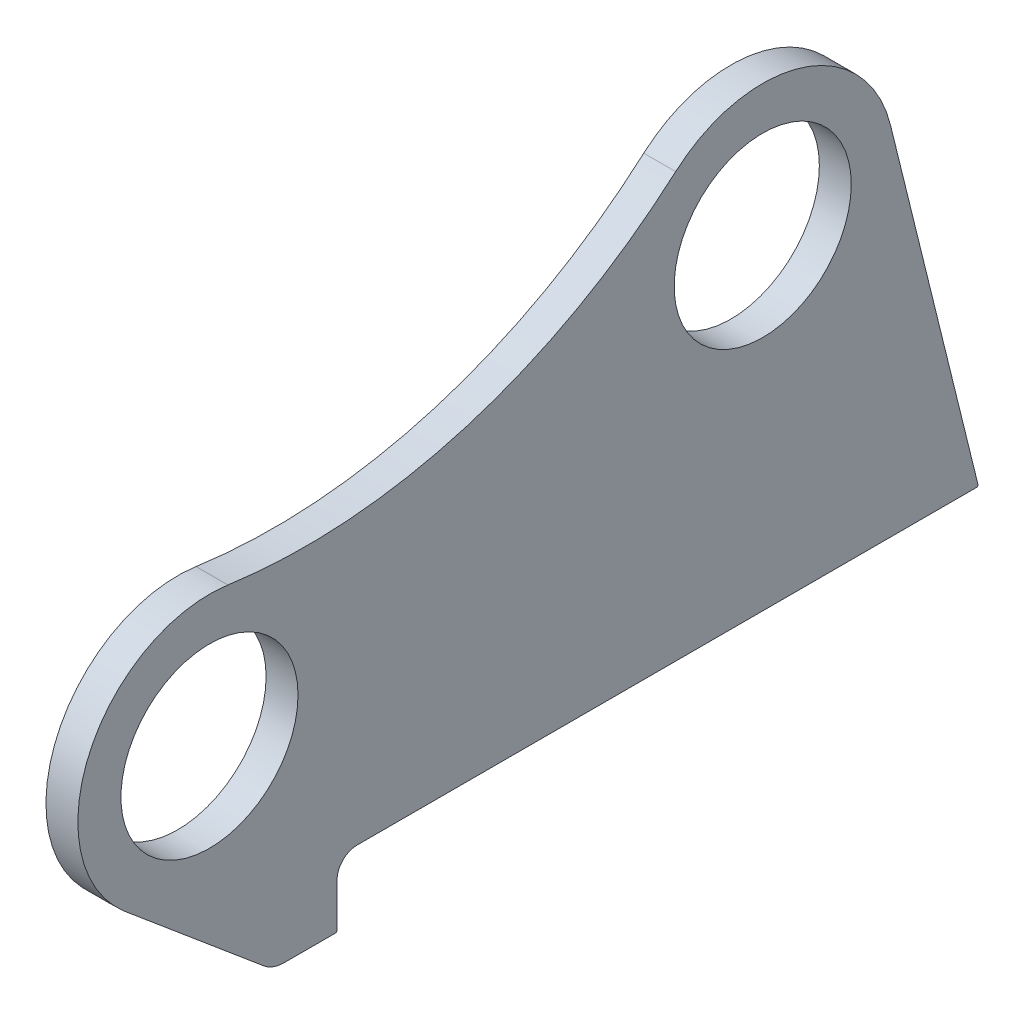
ISO-10303-21;
HEADER;
FILE_DESCRIPTION(('STEP AP214'),'2;1');
FILE_NAME('part.step','',(''),(''),'','','');
FILE_SCHEMA(('AUTOMOTIVE_DESIGN { 1 0 10303 214 1 1 1 1 }'));
ENDSEC;
DATA;
#1=APPLICATION_CONTEXT('core data for automotive mechanical design processes');
#2=APPLICATION_PROTOCOL_DEFINITION('international standard','automotive_design',2000,#1);
#3=PRODUCT_CONTEXT('',#1,'mechanical');
#4=PRODUCT('Part','Part','',(#3));
#5=PRODUCT_RELATED_PRODUCT_CATEGORY('part','',(#4));
#6=PRODUCT_DEFINITION_FORMATION('','',#4);
#7=PRODUCT_DEFINITION_CONTEXT('part definition',#1,'design');
#8=PRODUCT_DEFINITION('design','',#6,#7);
#9=PRODUCT_DEFINITION_SHAPE('','',#8);
#10=(LENGTH_UNIT() NAMED_UNIT(*) SI_UNIT(.MILLI.,.METRE.));
#11=(NAMED_UNIT(*) PLANE_ANGLE_UNIT() SI_UNIT($,.RADIAN.));
#12=(NAMED_UNIT(*) SI_UNIT($,.STERADIAN.) SOLID_ANGLE_UNIT());
#13=UNCERTAINTY_MEASURE_WITH_UNIT(LENGTH_MEASURE(1.E-05),#10,'distance_accuracy_value','');
#14=(GEOMETRIC_REPRESENTATION_CONTEXT(3) GLOBAL_UNCERTAINTY_ASSIGNED_CONTEXT((#13)) GLOBAL_UNIT_ASSIGNED_CONTEXT((#10,
#11,#12)) REPRESENTATION_CONTEXT('',''));
#15=CARTESIAN_POINT('',(0.,0.,0.));
#16=DIRECTION('',(0.,0.,1.));
#17=DIRECTION('',(1.,0.,0.));
#18=AXIS2_PLACEMENT_3D('',#15,#16,#17);
#19=CARTESIAN_POINT('',(-20.,528.222617801825,19.3234839253683));
#20=DIRECTION('',(1.,0.,0.));
#21=DIRECTION('',(0.,0.,-1.));
#22=AXIS2_PLACEMENT_3D('',#19,#20,#21);
#23=CYLINDRICAL_SURFACE('',#22,350.);
#24=CARTESIAN_POINT('',(0.,528.222617801825,19.3234839253683));
#25=DIRECTION('',(-1.,0.,0.));
#26=DIRECTION('',(0.,0.,-1.));
#27=AXIS2_PLACEMENT_3D('',#24,#25,#26);
#28=CIRCLE('',#27,350.);
#29=CARTESIAN_POINT('',(0.,265.74316224697,-212.203048920495));
#30=VERTEX_POINT('',#29);
#31=CARTESIAN_POINT('',(0.,181.684083164513,68.4258668759373));
#32=VERTEX_POINT('',#31);
#33=EDGE_CURVE('E179',#30,#32,#28,.T.);
#34=ORIENTED_EDGE('',*,*,#33,.F.);
#35=DIRECTION('',(1.,0.,0.));
#36=VECTOR('',#35,1.);
#37=CARTESIAN_POINT('',(-20.,265.74316224697,-212.203048920495));
#38=LINE('',#37,#36);
#39=CARTESIAN_POINT('',(-20.,265.74316224697,-212.203048920495));
#40=VERTEX_POINT('',#39);
#41=EDGE_CURVE('E152',#40,#30,#38,.T.);
#42=ORIENTED_EDGE('',*,*,#41,.F.);
#43=CARTESIAN_POINT('',(-20.,528.222617801825,19.3234839253683));
#44=DIRECTION('',(-1.,0.,0.));
#45=DIRECTION('',(0.,0.,-1.));
#46=AXIS2_PLACEMENT_3D('',#43,#44,#45);
#47=CIRCLE('',#46,350.);
#48=CARTESIAN_POINT('',(-20.,181.684083164513,68.4258668759373));
#49=VERTEX_POINT('',#48);
#50=EDGE_CURVE('E146',#40,#49,#47,.T.);
#51=ORIENTED_EDGE('',*,*,#50,.T.);
#52=DIRECTION('',(1.,0.,0.));
#53=VECTOR('',#52,1.);
#54=CARTESIAN_POINT('',(-20.,181.684083164513,68.4258668759373));
#55=LINE('',#54,#53);
#56=EDGE_CURVE('E128',#49,#32,#55,.T.);
#57=ORIENTED_EDGE('',*,*,#56,.T.);
#58=EDGE_LOOP('',(#34,#42,#51,#57));
#59=FACE_BOUND('',#58,.T.);
#60=ADVANCED_FACE('F39',(#59),#23,.F.);
#61=CARTESIAN_POINT('',(-20.,203.873004866183,-266.777160234163));
#62=DIRECTION('',(1.,0.,0.));
#63=DIRECTION('',(0.,0.,-1.));
#64=AXIS2_PLACEMENT_3D('',#61,#62,#63);
#65=CYLINDRICAL_SURFACE('',#64,82.5);
#66=CARTESIAN_POINT('',(0.,203.873004866183,-266.777160234163));
#67=DIRECTION('',(1.,0.,0.));
#68=DIRECTION('',(0.,0.,-1.));
#69=AXIS2_PLACEMENT_3D('',#66,#67,#68);
#70=CIRCLE('',#69,82.5);
#71=CARTESIAN_POINT('',(0.,223.617766638744,-346.879559589893));
#72=VERTEX_POINT('',#71);
#73=EDGE_CURVE('E153',#72,#30,#70,.T.);
#74=ORIENTED_EDGE('',*,*,#73,.F.);
#75=DIRECTION('',(1.,0.,0.));
#76=VECTOR('',#75,1.);
#77=CARTESIAN_POINT('',(-20.,223.617766638744,-346.879559589893));
#78=LINE('',#77,#76);
#79=CARTESIAN_POINT('',(-20.,223.617766638744,-346.879559589893));
#80=VERTEX_POINT('',#79);
#81=EDGE_CURVE('E203',#80,#72,#78,.T.);
#82=ORIENTED_EDGE('',*,*,#81,.F.);
#83=CARTESIAN_POINT('',(-20.,203.873004866183,-266.777160234163));
#84=DIRECTION('',(1.,0.,0.));
#85=DIRECTION('',(0.,0.,-1.));
#86=AXIS2_PLACEMENT_3D('',#83,#84,#85);
#87=CIRCLE('',#86,82.5);
#88=EDGE_CURVE('E139',#80,#40,#87,.T.);
#89=ORIENTED_EDGE('',*,*,#88,.T.);
#90=ORIENTED_EDGE('',*,*,#41,.T.);
#91=EDGE_LOOP('',(#74,#82,#89,#90));
#92=FACE_BOUND('',#91,.T.);
#93=ADVANCED_FACE('F244',(#92),#65,.T.);
#94=CARTESIAN_POINT('',(-20.,0.,-402.));
#95=DIRECTION('',(0.,0.239330445728009,-0.970938174008846));
#96=DIRECTION('',(0.,0.970938174008846,0.239330445728009));
#97=AXIS2_PLACEMENT_3D('',#94,#95,#96);
#98=PLANE('',#97);
#99=DIRECTION('',(0.,0.970938174008846,0.239330445728009));
#100=VECTOR('',#99,1.);
#101=CARTESIAN_POINT('',(0.,0.,-402.));
#102=LINE('',#101,#100);
#103=CARTESIAN_POINT('',(0.,1.239330445728,-401.694512466478));
#104=VERTEX_POINT('',#103);
#105=EDGE_CURVE('E156',#104,#72,#102,.T.);
#106=ORIENTED_EDGE('',*,*,#105,.F.);
#107=DIRECTION('',(1.,0.,0.));
#108=VECTOR('',#107,1.);
#109=CARTESIAN_POINT('',(-20.,1.239330445728,-401.694512466478));
#110=LINE('',#109,#108);
#111=CARTESIAN_POINT('',(-20.,1.239330445728,-401.694512466478));
#112=VERTEX_POINT('',#111);
#113=EDGE_CURVE('E222',#104,#112,#110,.F.);
#114=ORIENTED_EDGE('',*,*,#113,.T.);
#115=DIRECTION('',(0.,0.970938174008846,0.239330445728009));
#116=VECTOR('',#115,1.);
#117=CARTESIAN_POINT('',(-20.,0.,-402.));
#118=LINE('',#117,#116);
#119=EDGE_CURVE('E176',#112,#80,#118,.T.);
#120=ORIENTED_EDGE('',*,*,#119,.T.);
#121=ORIENTED_EDGE('',*,*,#81,.T.);
#122=EDGE_LOOP('',(#106,#114,#120,#121));
#123=FACE_BOUND('',#122,.T.);
#124=ADVANCED_FACE('F270',(#123),#98,.T.);
#125=CARTESIAN_POINT('',(-20.,0.,-12.5));
#126=DIRECTION('',(0.,-1.,0.));
#127=DIRECTION('',(0.,0.,-1.));
#128=AXIS2_PLACEMENT_3D('',#125,#126,#127);
#129=PLANE('',#128);
#130=DIRECTION('',(0.,0.,-1.));
#131=VECTOR('',#130,1.);
#132=CARTESIAN_POINT('',(-20.,0.,-12.5));
#133=LINE('',#132,#131);
#134=CARTESIAN_POINT('',(-20.,0.,-12.5));
#135=VERTEX_POINT('',#134);
#136=CARTESIAN_POINT('',(-20.,0.,-400.723574292469));
#137=VERTEX_POINT('',#136);
#138=EDGE_CURVE('E173',#135,#137,#133,.T.);
#139=ORIENTED_EDGE('',*,*,#138,.T.);
#140=DIRECTION('',(1.,0.,0.));
#141=VECTOR('',#140,1.);
#142=CARTESIAN_POINT('',(-20.,0.,-400.723574292469));
#143=LINE('',#142,#141);
#144=CARTESIAN_POINT('',(0.,0.,-400.723574292469));
#145=VERTEX_POINT('',#144);
#146=EDGE_CURVE('E202',#137,#145,#143,.T.);
#147=ORIENTED_EDGE('',*,*,#146,.T.);
#148=DIRECTION('',(0.,0.,-1.));
#149=VECTOR('',#148,1.);
#150=CARTESIAN_POINT('',(0.,0.,-12.5));
#151=LINE('',#150,#149);
#152=CARTESIAN_POINT('',(0.,0.,-12.5));
#153=VERTEX_POINT('',#152);
#154=EDGE_CURVE('E197',#153,#145,#151,.T.);
#155=ORIENTED_EDGE('',*,*,#154,.F.);
#156=DIRECTION('',(1.,0.,0.));
#157=VECTOR('',#156,1.);
#158=CARTESIAN_POINT('',(-20.,0.,-12.5));
#159=LINE('',#158,#157);
#160=EDGE_CURVE('E206',#135,#153,#159,.T.);
#161=ORIENTED_EDGE('',*,*,#160,.F.);
#162=EDGE_LOOP('',(#139,#147,#155,#161));
#163=FACE_BOUND('',#162,.T.);
#164=ADVANCED_FACE('F254',(#163),#129,.T.);
#165=CARTESIAN_POINT('',(-20.,-12.5,-12.5));
#166=DIRECTION('',(1.,0.,0.));
#167=DIRECTION('',(0.,0.,-1.));
#168=AXIS2_PLACEMENT_3D('',#165,#166,#167);
#169=CYLINDRICAL_SURFACE('',#168,12.5);
#170=CARTESIAN_POINT('',(0.,-12.5,-12.5));
#171=DIRECTION('',(-1.,0.,0.));
#172=DIRECTION('',(0.,0.,1.));
#173=AXIS2_PLACEMENT_3D('',#170,#171,#172);
#174=CIRCLE('',#173,12.5);
#175=CARTESIAN_POINT('',(0.,-12.5,0.));
#176=VERTEX_POINT('',#175);
#177=EDGE_CURVE('E194',#176,#153,#174,.T.);
#178=ORIENTED_EDGE('',*,*,#177,.F.);
#179=DIRECTION('',(1.,0.,0.));
#180=VECTOR('',#179,1.);
#181=CARTESIAN_POINT('',(-20.,-12.5,0.));
#182=LINE('',#181,#180);
#183=CARTESIAN_POINT('',(-20.,-12.5,0.));
#184=VERTEX_POINT('',#183);
#185=EDGE_CURVE('E208',#184,#176,#182,.T.);
#186=ORIENTED_EDGE('',*,*,#185,.F.);
#187=CARTESIAN_POINT('',(-20.,-12.5,-12.5));
#188=DIRECTION('',(-1.,0.,0.));
#189=DIRECTION('',(0.,0.,1.));
#190=AXIS2_PLACEMENT_3D('',#187,#188,#189);
#191=CIRCLE('',#190,12.5);
#192=EDGE_CURVE('E170',#184,#135,#191,.T.);
#193=ORIENTED_EDGE('',*,*,#192,.T.);
#194=ORIENTED_EDGE('',*,*,#160,.T.);
#195=EDGE_LOOP('',(#178,#186,#193,#194));
#196=FACE_BOUND('',#195,.T.);
#197=ADVANCED_FACE('F258',(#196),#169,.F.);
#198=CARTESIAN_POINT('',(-20.,-41.,0.));
#199=DIRECTION('',(0.,0.,-1.));
#200=DIRECTION('',(-1.,0.,0.));
#201=AXIS2_PLACEMENT_3D('',#198,#199,#200);
#202=PLANE('',#201);
#203=DIRECTION('',(0.,1.,0.));
#204=VECTOR('',#203,1.);
#205=CARTESIAN_POINT('',(0.,-41.,0.));
#206=LINE('',#205,#204);
#207=CARTESIAN_POINT('',(0.,-40.,0.));
#208=VERTEX_POINT('',#207);
#209=EDGE_CURVE('E192',#208,#176,#206,.T.);
#210=ORIENTED_EDGE('',*,*,#209,.F.);
#211=DIRECTION('',(1.,0.,0.));
#212=VECTOR('',#211,1.);
#213=CARTESIAN_POINT('',(-20.,-40.,0.));
#214=LINE('',#213,#212);
#215=CARTESIAN_POINT('',(-20.,-40.,0.));
#216=VERTEX_POINT('',#215);
#217=EDGE_CURVE('E11',#208,#216,#214,.F.);
#218=ORIENTED_EDGE('',*,*,#217,.T.);
#219=DIRECTION('',(0.,1.,0.));
#220=VECTOR('',#219,1.);
#221=CARTESIAN_POINT('',(-20.,-41.,0.));
#222=LINE('',#221,#220);
#223=EDGE_CURVE('E168',#216,#184,#222,.T.);
#224=ORIENTED_EDGE('',*,*,#223,.T.);
#225=ORIENTED_EDGE('',*,*,#185,.T.);
#226=EDGE_LOOP('',(#210,#218,#224,#225));
#227=FACE_BOUND('',#226,.T.);
#228=ADVANCED_FACE('F281',(#227),#202,.T.);
#229=CARTESIAN_POINT('',(-20.,-41.,0.));
#230=DIRECTION('',(0.,-1.,0.));
#231=DIRECTION('',(0.,0.,-1.));
#232=AXIS2_PLACEMENT_3D('',#229,#230,#231);
#233=PLANE('',#232);
#234=DIRECTION('',(0.,0.,-1.));
#235=VECTOR('',#234,1.);
#236=CARTESIAN_POINT('',(-20.,-41.,0.));
#237=LINE('',#236,#235);
#238=CARTESIAN_POINT('',(-20.,-41.,33.1096120214944));
#239=VERTEX_POINT('',#238);
#240=CARTESIAN_POINT('',(-20.,-41.,1.));
#241=VERTEX_POINT('',#240);
#242=EDGE_CURVE('E166',#239,#241,#237,.T.);
#243=ORIENTED_EDGE('',*,*,#242,.T.);
#244=DIRECTION('',(1.,0.,0.));
#245=VECTOR('',#244,1.);
#246=CARTESIAN_POINT('',(-20.,-41.,1.));
#247=LINE('',#246,#245);
#248=CARTESIAN_POINT('',(0.,-41.,1.));
#249=VERTEX_POINT('',#248);
#250=EDGE_CURVE('E47',#241,#249,#247,.T.);
#251=ORIENTED_EDGE('',*,*,#250,.T.);
#252=DIRECTION('',(0.,0.,-1.));
#253=VECTOR('',#252,1.);
#254=CARTESIAN_POINT('',(0.,-41.,0.));
#255=LINE('',#254,#253);
#256=CARTESIAN_POINT('',(0.,-41.,33.1096120214944));
#257=VERTEX_POINT('',#256);
#258=EDGE_CURVE('E189',#257,#249,#255,.T.);
#259=ORIENTED_EDGE('',*,*,#258,.F.);
#260=DIRECTION('',(1.,0.,0.));
#261=VECTOR('',#260,1.);
#262=CARTESIAN_POINT('',(-20.,-41.,33.1096120214944));
#263=LINE('',#262,#261);
#264=EDGE_CURVE('E211',#239,#257,#263,.T.);
#265=ORIENTED_EDGE('',*,*,#264,.F.);
#266=EDGE_LOOP('',(#243,#251,#259,#265));
#267=FACE_BOUND('',#266,.T.);
#268=ADVANCED_FACE('F230',(#267),#233,.T.);
#269=CARTESIAN_POINT('',(-20.,-21.,33.1096120214943));
#270=DIRECTION('',(1.,0.,0.));
#271=DIRECTION('',(0.,0.,-1.));
#272=AXIS2_PLACEMENT_3D('',#269,#270,#271);
#273=CYLINDRICAL_SURFACE('',#272,20.);
#274=CARTESIAN_POINT('',(0.,-21.,33.1096120214943));
#275=DIRECTION('',(1.,0.,0.));
#276=DIRECTION('',(0.,0.,-1.));
#277=AXIS2_PLACEMENT_3D('',#274,#275,#276);
#278=CIRCLE('',#277,20.);
#279=CARTESIAN_POINT('',(0.,-36.3151421434658,45.972209781101));
#280=VERTEX_POINT('',#279);
#281=EDGE_CURVE('E186',#280,#257,#278,.T.);
#282=ORIENTED_EDGE('',*,*,#281,.F.);
#283=DIRECTION('',(1.,0.,0.));
#284=VECTOR('',#283,1.);
#285=CARTESIAN_POINT('',(-20.,-36.3151421434658,45.972209781101));
#286=LINE('',#285,#284);
#287=CARTESIAN_POINT('',(-20.,-36.3151421434658,45.972209781101));
#288=VERTEX_POINT('',#287);
#289=EDGE_CURVE('E213',#288,#280,#286,.T.);
#290=ORIENTED_EDGE('',*,*,#289,.F.);
#291=CARTESIAN_POINT('',(-20.,-21.,33.1096120214943));
#292=DIRECTION('',(1.,0.,0.));
#293=DIRECTION('',(0.,0.,-1.));
#294=AXIS2_PLACEMENT_3D('',#291,#292,#293);
#295=CIRCLE('',#294,20.);
#296=EDGE_CURVE('E163',#288,#239,#295,.T.);
#297=ORIENTED_EDGE('',*,*,#296,.T.);
#298=ORIENTED_EDGE('',*,*,#264,.T.);
#299=EDGE_LOOP('',(#282,#290,#297,#298));
#300=FACE_BOUND('',#299,.T.);
#301=ADVANCED_FACE('F237',(#300),#273,.T.);
#302=CARTESIAN_POINT('',(-20.,36.8250386582074,133.058215758378));
#303=DIRECTION('',(0.,-0.765757107173288,0.643129887980334));
#304=DIRECTION('',(0.,-0.643129887980334,-0.765757107173288));
#305=AXIS2_PLACEMENT_3D('',#302,#303,#304);
#306=PLANE('',#305);
#307=DIRECTION('',(0.,-0.643129887980334,-0.765757107173288));
#308=VECTOR('',#307,1.);
#309=CARTESIAN_POINT('',(0.,36.8250386582074,133.058215758378));
#310=LINE('',#309,#308);
#311=CARTESIAN_POINT('',(0.,36.8250386582073,133.058215758378));
#312=VERTEX_POINT('',#311);
#313=EDGE_CURVE('E183',#312,#280,#310,.T.);
#314=ORIENTED_EDGE('',*,*,#313,.F.);
#315=DIRECTION('',(1.,0.,0.));
#316=VECTOR('',#315,1.);
#317=CARTESIAN_POINT('',(-20.,36.8250386582073,133.058215758378));
#318=LINE('',#317,#316);
#319=CARTESIAN_POINT('',(-20.,36.8250386582073,133.058215758378));
#320=VERTEX_POINT('',#319);
#321=EDGE_CURVE('E138',#320,#312,#318,.T.);
#322=ORIENTED_EDGE('',*,*,#321,.F.);
#323=DIRECTION('',(0.,-0.643129887980334,-0.765757107173288));
#324=VECTOR('',#323,1.);
#325=CARTESIAN_POINT('',(-20.,36.8250386582074,133.058215758378));
#326=LINE('',#325,#324);
#327=EDGE_CURVE('E150',#320,#288,#326,.T.);
#328=ORIENTED_EDGE('',*,*,#327,.T.);
#329=ORIENTED_EDGE('',*,*,#289,.T.);
#330=EDGE_LOOP('',(#314,#322,#328,#329));
#331=FACE_BOUND('',#330,.T.);
#332=ADVANCED_FACE('F239',(#331),#306,.T.);
#333=CARTESIAN_POINT('',(-20.,100.000000000004,80.));
#334=DIRECTION('',(1.,0.,0.));
#335=DIRECTION('',(0.,0.,-1.));
#336=AXIS2_PLACEMENT_3D('',#333,#334,#335);
#337=CYLINDRICAL_SURFACE('',#336,82.5);
#338=CARTESIAN_POINT('',(0.,100.000000000004,80.));
#339=DIRECTION('',(1.,0.,0.));
#340=DIRECTION('',(0.,0.,-1.));
#341=AXIS2_PLACEMENT_3D('',#338,#339,#340);
#342=CIRCLE('',#341,82.5);
#343=EDGE_CURVE('E133',#32,#312,#342,.T.);
#344=ORIENTED_EDGE('',*,*,#343,.F.);
#345=ORIENTED_EDGE('',*,*,#56,.F.);
#346=CARTESIAN_POINT('',(-20.,100.000000000004,80.));
#347=DIRECTION('',(1.,0.,0.));
#348=DIRECTION('',(0.,0.,-1.));
#349=AXIS2_PLACEMENT_3D('',#346,#347,#348);
#350=CIRCLE('',#349,82.5);
#351=EDGE_CURVE('E131',#49,#320,#350,.T.);
#352=ORIENTED_EDGE('',*,*,#351,.T.);
#353=ORIENTED_EDGE('',*,*,#321,.T.);
#354=EDGE_LOOP('',(#344,#345,#352,#353));
#355=FACE_BOUND('',#354,.T.);
#356=ADVANCED_FACE('F130',(#355),#337,.T.);
#357=CARTESIAN_POINT('',(-20.,528.222617801825,19.3234839253683));
#358=DIRECTION('',(1.,0.,0.));
#359=DIRECTION('',(0.,0.,-1.));
#360=AXIS2_PLACEMENT_3D('',#357,#358,#359);
#361=PLANE('',#360);
#362=CARTESIAN_POINT('',(-20.,203.873004866183,-266.777160234163));
#363=DIRECTION('',(1.,0.,0.));
#364=DIRECTION('',(0.,0.,-1.));
#365=AXIS2_PLACEMENT_3D('',#362,#363,#364);
#366=CIRCLE('',#365,55.5);
#367=CARTESIAN_POINT('',(-20.,203.873004866183,-322.277160234163));
#368=VERTEX_POINT('',#367);
#369=EDGE_CURVE('E307',#368,#368,#366,.T.);
#370=ORIENTED_EDGE('',*,*,#369,.T.);
#371=EDGE_LOOP('',(#370));
#372=FACE_BOUND('',#371,.T.);
#373=CARTESIAN_POINT('',(-20.,100.000000000004,80.));
#374=DIRECTION('',(1.,0.,0.));
#375=DIRECTION('',(0.,0.,-1.));
#376=AXIS2_PLACEMENT_3D('',#373,#374,#375);
#377=CIRCLE('',#376,55.5);
#378=CARTESIAN_POINT('',(-20.,100.000000000004,24.5));
#379=VERTEX_POINT('',#378);
#380=EDGE_CURVE('E181',#379,#379,#377,.T.);
#381=ORIENTED_EDGE('',*,*,#380,.T.);
#382=EDGE_LOOP('',(#381));
#383=FACE_BOUND('',#382,.T.);
#384=ORIENTED_EDGE('',*,*,#119,.F.);
#385=CARTESIAN_POINT('',(-20.,1.,-400.723574292469));
#386=DIRECTION('',(1.,0.,0.));
#387=DIRECTION('',(0.,0.,-1.));
#388=AXIS2_PLACEMENT_3D('',#385,#386,#387);
#389=CIRCLE('',#388,1.);
#390=EDGE_CURVE('E225',#112,#137,#389,.F.);
#391=ORIENTED_EDGE('',*,*,#390,.T.);
#392=ORIENTED_EDGE('',*,*,#138,.F.);
#393=ORIENTED_EDGE('',*,*,#192,.F.);
#394=ORIENTED_EDGE('',*,*,#223,.F.);
#395=CARTESIAN_POINT('',(-20.,-40.,1.));
#396=DIRECTION('',(1.,0.,0.));
#397=DIRECTION('',(0.,0.,-1.));
#398=AXIS2_PLACEMENT_3D('',#395,#396,#397);
#399=CIRCLE('',#398,1.);
#400=EDGE_CURVE('E54',#216,#241,#399,.F.);
#401=ORIENTED_EDGE('',*,*,#400,.T.);
#402=ORIENTED_EDGE('',*,*,#242,.F.);
#403=ORIENTED_EDGE('',*,*,#296,.F.);
#404=ORIENTED_EDGE('',*,*,#327,.F.);
#405=ORIENTED_EDGE('',*,*,#351,.F.);
#406=ORIENTED_EDGE('',*,*,#50,.F.);
#407=ORIENTED_EDGE('',*,*,#88,.F.);
#408=EDGE_LOOP('',(#384,#391,#392,#393,#394,#401,#402,#403,#404,#405,#406,#407));
#409=FACE_BOUND('',#408,.T.);
#410=ADVANCED_FACE('F144',(#372,#383,#409),#361,.F.);
#411=CARTESIAN_POINT('',(0.,528.222617801825,19.3234839253683));
#412=DIRECTION('',(1.,0.,0.));
#413=DIRECTION('',(0.,0.,-1.));
#414=AXIS2_PLACEMENT_3D('',#411,#412,#413);
#415=PLANE('',#414);
#416=CARTESIAN_POINT('',(0.,203.873004866183,-266.777160234163));
#417=DIRECTION('',(1.,0.,0.));
#418=DIRECTION('',(0.,0.,-1.));
#419=AXIS2_PLACEMENT_3D('',#416,#417,#418);
#420=CIRCLE('',#419,55.5);
#421=CARTESIAN_POINT('',(0.,203.873004866183,-322.277160234163));
#422=VERTEX_POINT('',#421);
#423=EDGE_CURVE('E310',#422,#422,#420,.T.);
#424=ORIENTED_EDGE('',*,*,#423,.F.);
#425=EDGE_LOOP('',(#424));
#426=FACE_BOUND('',#425,.T.);
#427=CARTESIAN_POINT('',(0.,100.000000000004,80.));
#428=DIRECTION('',(1.,0.,0.));
#429=DIRECTION('',(0.,0.,-1.));
#430=AXIS2_PLACEMENT_3D('',#427,#428,#429);
#431=CIRCLE('',#430,55.5);
#432=CARTESIAN_POINT('',(0.,100.000000000004,24.5));
#433=VERTEX_POINT('',#432);
#434=EDGE_CURVE('E159',#433,#433,#431,.T.);
#435=ORIENTED_EDGE('',*,*,#434,.F.);
#436=EDGE_LOOP('',(#435));
#437=FACE_BOUND('',#436,.T.);
#438=ORIENTED_EDGE('',*,*,#154,.T.);
#439=CARTESIAN_POINT('',(0.,1.,-400.723574292469));
#440=DIRECTION('',(1.,0.,0.));
#441=DIRECTION('',(0.,0.,-1.));
#442=AXIS2_PLACEMENT_3D('',#439,#440,#441);
#443=CIRCLE('',#442,1.);
#444=EDGE_CURVE('E220',#145,#104,#443,.T.);
#445=ORIENTED_EDGE('',*,*,#444,.T.);
#446=ORIENTED_EDGE('',*,*,#105,.T.);
#447=ORIENTED_EDGE('',*,*,#73,.T.);
#448=ORIENTED_EDGE('',*,*,#33,.T.);
#449=ORIENTED_EDGE('',*,*,#343,.T.);
#450=ORIENTED_EDGE('',*,*,#313,.T.);
#451=ORIENTED_EDGE('',*,*,#281,.T.);
#452=ORIENTED_EDGE('',*,*,#258,.T.);
#453=CARTESIAN_POINT('',(0.,-40.,1.));
#454=DIRECTION('',(1.,0.,0.));
#455=DIRECTION('',(0.,0.,-1.));
#456=AXIS2_PLACEMENT_3D('',#453,#454,#455);
#457=CIRCLE('',#456,1.);
#458=EDGE_CURVE('E218',#249,#208,#457,.T.);
#459=ORIENTED_EDGE('',*,*,#458,.T.);
#460=ORIENTED_EDGE('',*,*,#209,.T.);
#461=ORIENTED_EDGE('',*,*,#177,.T.);
#462=EDGE_LOOP('',(#438,#445,#446,#447,#448,#449,#450,#451,#452,#459,#460,#461));
#463=FACE_BOUND('',#462,.T.);
#464=ADVANCED_FACE('F233',(#426,#437,#463),#415,.T.);
#465=CARTESIAN_POINT('',(-20.,100.000000000004,80.));
#466=DIRECTION('',(1.,0.,0.));
#467=DIRECTION('',(0.,0.,-1.));
#468=AXIS2_PLACEMENT_3D('',#465,#466,#467);
#469=CYLINDRICAL_SURFACE('',#468,55.5);
#470=ORIENTED_EDGE('',*,*,#380,.F.);
#471=EDGE_LOOP('',(#470));
#472=FACE_BOUND('',#471,.T.);
#473=ORIENTED_EDGE('',*,*,#434,.T.);
#474=EDGE_LOOP('',(#473));
#475=FACE_BOUND('',#474,.T.);
#476=ADVANCED_FACE('F292',(#472,#475),#469,.F.);
#477=CARTESIAN_POINT('',(-20.,203.873004866183,-266.777160234163));
#478=DIRECTION('',(1.,0.,0.));
#479=DIRECTION('',(0.,0.,-1.));
#480=AXIS2_PLACEMENT_3D('',#477,#478,#479);
#481=CYLINDRICAL_SURFACE('',#480,55.5);
#482=ORIENTED_EDGE('',*,*,#369,.F.);
#483=EDGE_LOOP('',(#482));
#484=FACE_BOUND('',#483,.T.);
#485=ORIENTED_EDGE('',*,*,#423,.T.);
#486=EDGE_LOOP('',(#485));
#487=FACE_BOUND('',#486,.T.);
#488=ADVANCED_FACE('F264',(#484,#487),#481,.F.);
#489=CARTESIAN_POINT('',(-20.,1.,-400.723574292469));
#490=DIRECTION('',(1.,0.,0.));
#491=DIRECTION('',(0.,0.,-1.));
#492=AXIS2_PLACEMENT_3D('',#489,#490,#491);
#493=CYLINDRICAL_SURFACE('',#492,1.);
#494=ORIENTED_EDGE('',*,*,#390,.F.);
#495=ORIENTED_EDGE('',*,*,#113,.F.);
#496=ORIENTED_EDGE('',*,*,#444,.F.);
#497=ORIENTED_EDGE('',*,*,#146,.F.);
#498=EDGE_LOOP('',(#494,#495,#496,#497));
#499=FACE_BOUND('',#498,.T.);
#500=ADVANCED_FACE('F251',(#499),#493,.T.);
#501=CARTESIAN_POINT('',(-20.,-40.,1.));
#502=DIRECTION('',(1.,0.,0.));
#503=DIRECTION('',(0.,0.,-1.));
#504=AXIS2_PLACEMENT_3D('',#501,#502,#503);
#505=CYLINDRICAL_SURFACE('',#504,1.);
#506=ORIENTED_EDGE('',*,*,#400,.F.);
#507=ORIENTED_EDGE('',*,*,#217,.F.);
#508=ORIENTED_EDGE('',*,*,#458,.F.);
#509=ORIENTED_EDGE('',*,*,#250,.F.);
#510=EDGE_LOOP('',(#506,#507,#508,#509));
#511=FACE_BOUND('',#510,.T.);
#512=ADVANCED_FACE('F41',(#511),#505,.T.);
#513=CLOSED_SHELL('',(#60,#93,#124,#164,#197,#228,#268,#301,#332,#356,#410,#464,#476,#488,#500,#512));
#514=MANIFOLD_SOLID_BREP('B2',#513);
#515=ADVANCED_BREP_SHAPE_REPRESENTATION('',(#18,#514),#14);
#516=SHAPE_DEFINITION_REPRESENTATION(#9,#515);
ENDSEC;
END-ISO-10303-21;
